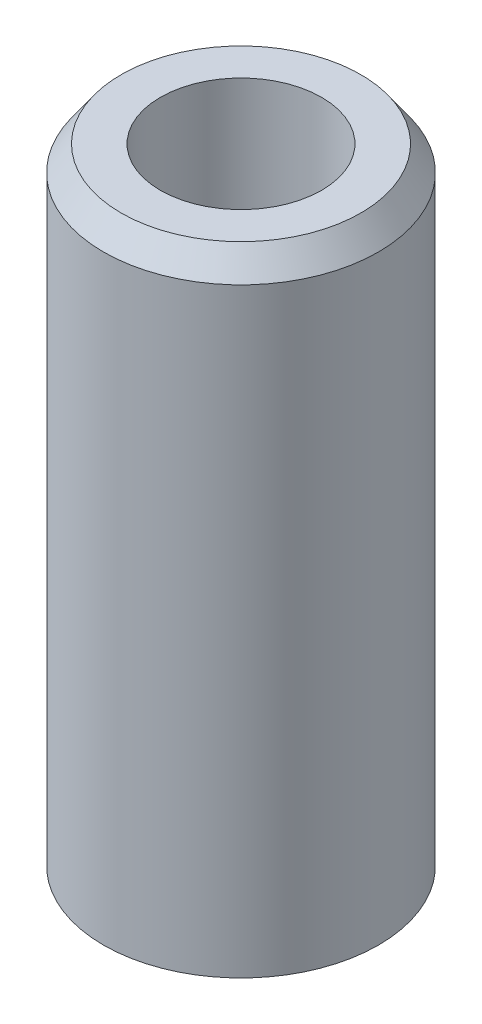
ISO-10303-21;
HEADER;
FILE_DESCRIPTION(('STEP AP214'),'2;1');
FILE_NAME('part.step','',(''),(''),'','','');
FILE_SCHEMA(('AUTOMOTIVE_DESIGN { 1 0 10303 214 1 1 1 1 }'));
ENDSEC;
DATA;
#1=APPLICATION_CONTEXT('core data for automotive mechanical design processes');
#2=APPLICATION_PROTOCOL_DEFINITION('international standard','automotive_design',2000,#1);
#3=PRODUCT_CONTEXT('',#1,'mechanical');
#4=PRODUCT('Part','Part','',(#3));
#5=PRODUCT_RELATED_PRODUCT_CATEGORY('part','',(#4));
#6=PRODUCT_DEFINITION_FORMATION('','',#4);
#7=PRODUCT_DEFINITION_CONTEXT('part definition',#1,'design');
#8=PRODUCT_DEFINITION('design','',#6,#7);
#9=PRODUCT_DEFINITION_SHAPE('','',#8);
#10=(LENGTH_UNIT() NAMED_UNIT(*) SI_UNIT(.MILLI.,.METRE.));
#11=(NAMED_UNIT(*) PLANE_ANGLE_UNIT() SI_UNIT($,.RADIAN.));
#12=(NAMED_UNIT(*) SI_UNIT($,.STERADIAN.) SOLID_ANGLE_UNIT());
#13=UNCERTAINTY_MEASURE_WITH_UNIT(LENGTH_MEASURE(1.E-05),#10,'distance_accuracy_value','');
#14=(GEOMETRIC_REPRESENTATION_CONTEXT(3) GLOBAL_UNCERTAINTY_ASSIGNED_CONTEXT((#13)) GLOBAL_UNIT_ASSIGNED_CONTEXT((#10,
#11,#12)) REPRESENTATION_CONTEXT('',''));
#15=CARTESIAN_POINT('',(0.,0.,0.));
#16=DIRECTION('',(0.,0.,1.));
#17=DIRECTION('',(1.,0.,0.));
#18=AXIS2_PLACEMENT_3D('',#15,#16,#17);
#19=CARTESIAN_POINT('',(0.,128.582482353089,0.));
#20=DIRECTION('',(0.,-1.,0.));
#21=DIRECTION('',(0.,0.,-1.));
#22=AXIS2_PLACEMENT_3D('',#19,#20,#21);
#23=CYLINDRICAL_SURFACE('',#22,27.5);
#24=CARTESIAN_POINT('',(0.,123.590242182315,0.));
#25=DIRECTION('',(0.,1.,0.));
#26=DIRECTION('',(0.,0.,1.));
#27=AXIS2_PLACEMENT_3D('',#24,#25,#26);
#28=CIRCLE('',#27,27.5);
#29=CARTESIAN_POINT('',(0.,123.590242182315,27.5));
#30=VERTEX_POINT('',#29);
#31=EDGE_CURVE('E50',#30,#30,#28,.F.);
#32=ORIENTED_EDGE('',*,*,#31,.T.);
#33=EDGE_LOOP('',(#32));
#34=FACE_BOUND('',#33,.T.);
#35=CARTESIAN_POINT('',(0.,3.52107944811697,0.));
#36=DIRECTION('',(0.,1.,0.));
#37=DIRECTION('',(0.,0.,1.));
#38=AXIS2_PLACEMENT_3D('',#35,#36,#37);
#39=CIRCLE('',#38,27.5);
#40=CARTESIAN_POINT('',(0.,3.52107944811697,27.5));
#41=VERTEX_POINT('',#40);
#42=EDGE_CURVE('E51',#41,#41,#39,.T.);
#43=ORIENTED_EDGE('',*,*,#42,.T.);
#44=EDGE_LOOP('',(#43));
#45=FACE_BOUND('',#44,.T.);
#46=ADVANCED_FACE('F39',(#34,#45),#23,.T.);
#47=CARTESIAN_POINT('',(0.,128.582482353089,0.));
#48=DIRECTION('',(0.,1.,0.));
#49=DIRECTION('',(0.,0.,1.));
#50=AXIS2_PLACEMENT_3D('',#47,#48,#49);
#51=PLANE('',#50);
#52=CARTESIAN_POINT('',(0.,128.582482353089,0.));
#53=DIRECTION('',(0.,1.,0.));
#54=DIRECTION('',(0.,0.,1.));
#55=AXIS2_PLACEMENT_3D('',#52,#53,#54);
#56=CIRCLE('',#55,23.978920551883);
#57=CARTESIAN_POINT('',(0.,128.582482353089,23.978920551883));
#58=VERTEX_POINT('',#57);
#59=EDGE_CURVE('E54',#58,#58,#56,.T.);
#60=ORIENTED_EDGE('',*,*,#59,.T.);
#61=EDGE_LOOP('',(#60));
#62=FACE_BOUND('',#61,.T.);
#63=CARTESIAN_POINT('',(0.,128.582482353089,0.));
#64=DIRECTION('',(0.,1.,0.));
#65=DIRECTION('',(0.,0.,1.));
#66=AXIS2_PLACEMENT_3D('',#63,#64,#65);
#67=CIRCLE('',#66,16.124163975611);
#68=CARTESIAN_POINT('',(0.,128.582482353089,16.124163975611));
#69=VERTEX_POINT('',#68);
#70=EDGE_CURVE('E58',#69,#69,#67,.T.);
#71=ORIENTED_EDGE('',*,*,#70,.F.);
#72=EDGE_LOOP('',(#71));
#73=FACE_BOUND('',#72,.T.);
#74=ADVANCED_FACE('F69',(#62,#73),#51,.T.);
#75=CARTESIAN_POINT('',(0.,0.,0.));
#76=DIRECTION('',(0.,1.,0.));
#77=DIRECTION('',(0.,0.,1.));
#78=AXIS2_PLACEMENT_3D('',#75,#76,#77);
#79=PLANE('',#78);
#80=CARTESIAN_POINT('',(0.,0.,0.));
#81=DIRECTION('',(0.,1.,0.));
#82=DIRECTION('',(0.,0.,1.));
#83=AXIS2_PLACEMENT_3D('',#80,#81,#82);
#84=CIRCLE('',#83,22.5077598292264);
#85=CARTESIAN_POINT('',(0.,0.,22.5077598292264));
#86=VERTEX_POINT('',#85);
#87=EDGE_CURVE('E10',#86,#86,#84,.F.);
#88=ORIENTED_EDGE('',*,*,#87,.T.);
#89=EDGE_LOOP('',(#88));
#90=FACE_BOUND('',#89,.T.);
#91=CARTESIAN_POINT('',(0.,0.,0.));
#92=DIRECTION('',(0.,1.,0.));
#93=DIRECTION('',(0.,0.,1.));
#94=AXIS2_PLACEMENT_3D('',#91,#92,#93);
#95=CIRCLE('',#94,16.124163975611);
#96=CARTESIAN_POINT('',(0.,0.,16.124163975611));
#97=VERTEX_POINT('',#96);
#98=EDGE_CURVE('E63',#97,#97,#95,.T.);
#99=ORIENTED_EDGE('',*,*,#98,.T.);
#100=EDGE_LOOP('',(#99));
#101=FACE_BOUND('',#100,.T.);
#102=ADVANCED_FACE('F75',(#90,#101),#79,.F.);
#103=CARTESIAN_POINT('',(0.,128.582482353089,0.));
#104=DIRECTION('',(0.,-1.,0.));
#105=DIRECTION('',(0.,0.,-1.));
#106=AXIS2_PLACEMENT_3D('',#103,#104,#105);
#107=CYLINDRICAL_SURFACE('',#106,16.124163975611);
#108=ORIENTED_EDGE('',*,*,#70,.T.);
#109=EDGE_LOOP('',(#108));
#110=FACE_BOUND('',#109,.T.);
#111=ORIENTED_EDGE('',*,*,#98,.F.);
#112=EDGE_LOOP('',(#111));
#113=FACE_BOUND('',#112,.T.);
#114=ADVANCED_FACE('F70',(#110,#113),#107,.F.);
#115=CARTESIAN_POINT('',(0.,128.582482353089,0.));
#116=DIRECTION('',(0.,-1.,0.));
#117=DIRECTION('',(0.,0.,-1.));
#118=AXIS2_PLACEMENT_3D('',#115,#116,#117);
#119=CONICAL_SURFACE('',#118,23.978920551883,0.614281178532362);
#120=ORIENTED_EDGE('',*,*,#31,.F.);
#121=EDGE_LOOP('',(#120));
#122=FACE_BOUND('',#121,.T.);
#123=ORIENTED_EDGE('',*,*,#59,.F.);
#124=EDGE_LOOP('',(#123));
#125=FACE_BOUND('',#124,.T.);
#126=ADVANCED_FACE('F81',(#122,#125),#119,.T.);
#127=CARTESIAN_POINT('',(0.,3.52107944811697,0.));
#128=DIRECTION('',(0.,1.,0.));
#129=DIRECTION('',(0.,0.,1.));
#130=AXIS2_PLACEMENT_3D('',#127,#128,#129);
#131=CONICAL_SURFACE('',#130,27.5,0.956515148262538);
#132=ORIENTED_EDGE('',*,*,#87,.F.);
#133=EDGE_LOOP('',(#132));
#134=FACE_BOUND('',#133,.T.);
#135=ORIENTED_EDGE('',*,*,#42,.F.);
#136=EDGE_LOOP('',(#135));
#137=FACE_BOUND('',#136,.T.);
#138=ADVANCED_FACE('F45',(#134,#137),#131,.T.);
#139=CLOSED_SHELL('',(#46,#74,#102,#114,#126,#138));
#140=MANIFOLD_SOLID_BREP('B2',#139);
#141=ADVANCED_BREP_SHAPE_REPRESENTATION('',(#18,#140),#14);
#142=SHAPE_DEFINITION_REPRESENTATION(#9,#141);
ENDSEC;
END-ISO-10303-21;
